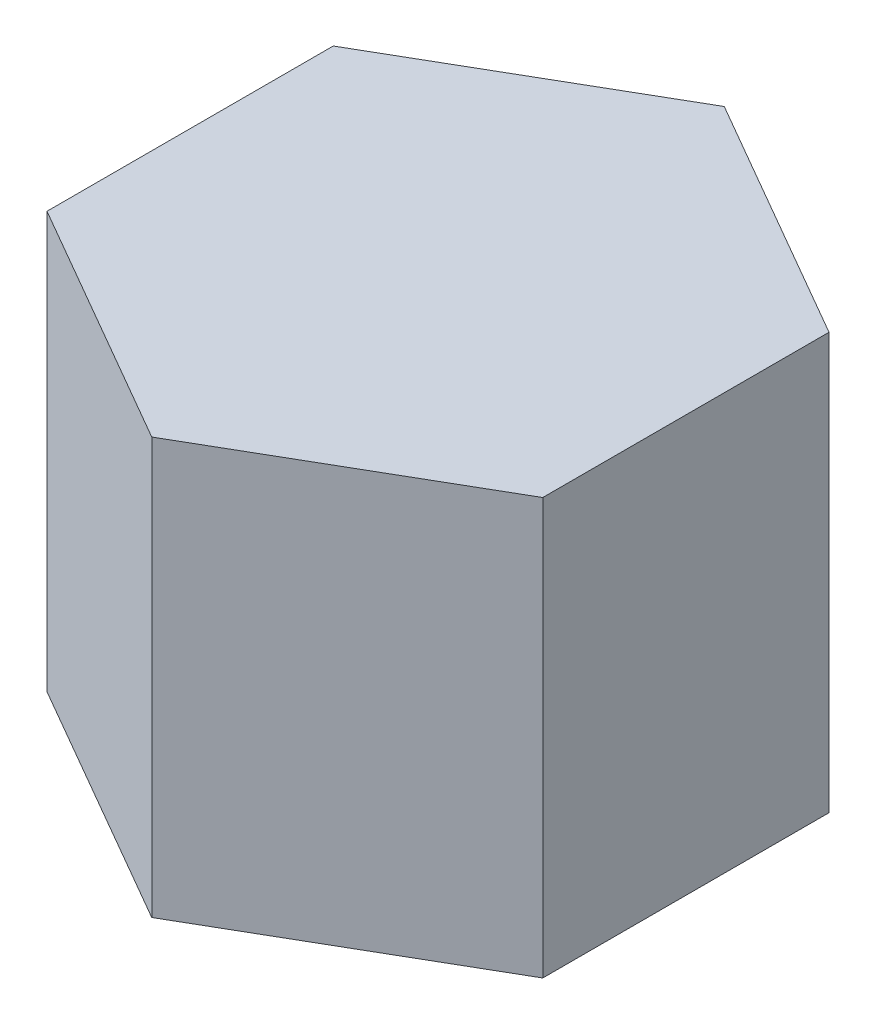
ISO-10303-21;
HEADER;
FILE_DESCRIPTION(('STEP AP214'),'2;1');
FILE_NAME('part.step','',(''),(''),'','','');
FILE_SCHEMA(('AUTOMOTIVE_DESIGN { 1 0 10303 214 1 1 1 1 }'));
ENDSEC;
DATA;
#1=APPLICATION_CONTEXT('core data for automotive mechanical design processes');
#2=APPLICATION_PROTOCOL_DEFINITION('international standard','automotive_design',2000,#1);
#3=PRODUCT_CONTEXT('',#1,'mechanical');
#4=PRODUCT('Part','Part','',(#3));
#5=PRODUCT_RELATED_PRODUCT_CATEGORY('part','',(#4));
#6=PRODUCT_DEFINITION_FORMATION('','',#4);
#7=PRODUCT_DEFINITION_CONTEXT('part definition',#1,'design');
#8=PRODUCT_DEFINITION('design','',#6,#7);
#9=PRODUCT_DEFINITION_SHAPE('','',#8);
#10=(LENGTH_UNIT() NAMED_UNIT(*) SI_UNIT(.MILLI.,.METRE.));
#11=(NAMED_UNIT(*) PLANE_ANGLE_UNIT() SI_UNIT($,.RADIAN.));
#12=(NAMED_UNIT(*) SI_UNIT($,.STERADIAN.) SOLID_ANGLE_UNIT());
#13=UNCERTAINTY_MEASURE_WITH_UNIT(LENGTH_MEASURE(1.E-05),#10,'distance_accuracy_value','');
#14=(GEOMETRIC_REPRESENTATION_CONTEXT(3) GLOBAL_UNCERTAINTY_ASSIGNED_CONTEXT((#13)) GLOBAL_UNIT_ASSIGNED_CONTEXT((#10,
#11,#12)) REPRESENTATION_CONTEXT('',''));
#15=CARTESIAN_POINT('',(0.,0.,0.));
#16=DIRECTION('',(0.,0.,1.));
#17=DIRECTION('',(1.,0.,0.));
#18=AXIS2_PLACEMENT_3D('',#15,#16,#17);
#19=CARTESIAN_POINT('',(205.839551417382,-147.556598747966,296.012098239417));
#20=DIRECTION('',(-0.500000000000096,0.,-0.866025403784383));
#21=DIRECTION('',(-0.866025403784383,0.,0.500000000000096));
#22=AXIS2_PLACEMENT_3D('',#19,#20,#21);
#23=PLANE('',#22);
#24=CARTESIAN_POINT('',(206.142660308706,-147.047793579175,295.837098239417));
#25=DIRECTION('',(-0.866025403784383,0.,0.500000000000096));
#26=VECTOR('',#25,1.);
#27=LINE('',#24,#26);
#28=CARTESIAN_POINT('',(206.142660308706,-147.047793579175,295.837098239417));
#29=VERTEX_POINT('',#28);
#30=CARTESIAN_POINT('',(205.839551417382,-147.047793579175,296.012098239417));
#31=VERTEX_POINT('',#30);
#32=EDGE_CURVE('E170',#29,#31,#27,.T.);
#33=ORIENTED_EDGE('',*,*,#32,.T.);
#34=CARTESIAN_POINT('',(205.839551417382,-147.556598747966,296.012098239417));
#35=DIRECTION('',(0.,1.,0.));
#36=VECTOR('',#35,1.);
#37=LINE('',#34,#36);
#38=CARTESIAN_POINT('',(205.839551417382,-147.556598747966,296.012098239417));
#39=VERTEX_POINT('',#38);
#40=EDGE_CURVE('E35',#39,#31,#37,.T.);
#41=ORIENTED_EDGE('',*,*,#40,.F.);
#42=CARTESIAN_POINT('',(206.142660308706,-147.556598747966,295.837098239417));
#43=DIRECTION('',(-0.866025403784383,0.,0.500000000000096));
#44=VECTOR('',#43,1.);
#45=LINE('',#42,#44);
#46=CARTESIAN_POINT('',(206.142660308706,-147.556598747966,295.837098239417));
#47=VERTEX_POINT('',#46);
#48=EDGE_CURVE('E159',#47,#39,#45,.T.);
#49=ORIENTED_EDGE('',*,*,#48,.F.);
#50=CARTESIAN_POINT('',(206.142660308706,-147.556598747966,295.837098239417));
#51=DIRECTION('',(0.,1.,0.));
#52=VECTOR('',#51,1.);
#53=LINE('',#50,#52);
#54=EDGE_CURVE('E10',#47,#29,#53,.T.);
#55=ORIENTED_EDGE('',*,*,#54,.T.);
#56=EDGE_LOOP('',(#33,#41,#49,#55));
#57=FACE_BOUND('',#56,.T.);
#58=ADVANCED_FACE('F16',(#57),#23,.F.);
#59=CARTESIAN_POINT('',(206.142660308706,-147.556598747966,291.594471220494));
#60=DIRECTION('',(-1.,0.,0.));
#61=DIRECTION('',(0.,-1.,0.));
#62=AXIS2_PLACEMENT_3D('',#59,#60,#61);
#63=PLANE('',#62);
#64=CARTESIAN_POINT('',(206.142660308706,-147.047793579175,295.487098239417));
#65=DIRECTION('',(0.,0.,1.));
#66=VECTOR('',#65,1.);
#67=LINE('',#64,#66);
#68=CARTESIAN_POINT('',(206.142660308706,-147.047793579175,295.487098239417));
#69=VERTEX_POINT('',#68);
#70=EDGE_CURVE('E167',#69,#29,#67,.T.);
#71=ORIENTED_EDGE('',*,*,#70,.T.);
#72=ORIENTED_EDGE('',*,*,#54,.F.);
#73=CARTESIAN_POINT('',(206.142660308706,-147.556598747966,295.487098239417));
#74=DIRECTION('',(0.,0.,1.));
#75=VECTOR('',#74,1.);
#76=LINE('',#73,#75);
#77=CARTESIAN_POINT('',(206.142660308706,-147.556598747966,295.487098239417));
#78=VERTEX_POINT('',#77);
#79=EDGE_CURVE('E156',#78,#47,#76,.T.);
#80=ORIENTED_EDGE('',*,*,#79,.F.);
#81=CARTESIAN_POINT('',(206.142660308706,-147.556598747966,295.487098239417));
#82=DIRECTION('',(0.,1.,0.));
#83=VECTOR('',#82,1.);
#84=LINE('',#81,#83);
#85=EDGE_CURVE('E27',#78,#69,#84,.T.);
#86=ORIENTED_EDGE('',*,*,#85,.T.);
#87=EDGE_LOOP('',(#71,#72,#80,#86));
#88=FACE_BOUND('',#87,.T.);
#89=ADVANCED_FACE('F189',(#88),#63,.F.);
#90=CARTESIAN_POINT('',(206.142660308706,-147.556598747966,295.487098239417));
#91=DIRECTION('',(-0.499999999999978,0.,0.866025403784452));
#92=DIRECTION('',(0.866025403784452,0.,0.499999999999978));
#93=AXIS2_PLACEMENT_3D('',#90,#91,#92);
#94=PLANE('',#93);
#95=CARTESIAN_POINT('',(205.839551417382,-147.047793579175,295.312098239417));
#96=DIRECTION('',(0.866025403784452,0.,0.499999999999978));
#97=VECTOR('',#96,1.);
#98=LINE('',#95,#97);
#99=CARTESIAN_POINT('',(205.839551417382,-147.047793579175,295.312098239417));
#100=VERTEX_POINT('',#99);
#101=EDGE_CURVE('E163',#100,#69,#98,.T.);
#102=ORIENTED_EDGE('',*,*,#101,.T.);
#103=ORIENTED_EDGE('',*,*,#85,.F.);
#104=CARTESIAN_POINT('',(205.839551417382,-147.556598747966,295.312098239417));
#105=DIRECTION('',(0.866025403784452,0.,0.499999999999978));
#106=VECTOR('',#105,1.);
#107=LINE('',#104,#106);
#108=CARTESIAN_POINT('',(205.839551417382,-147.556598747966,295.312098239417));
#109=VERTEX_POINT('',#108);
#110=EDGE_CURVE('E106',#109,#78,#107,.T.);
#111=ORIENTED_EDGE('',*,*,#110,.F.);
#112=CARTESIAN_POINT('',(205.839551417382,-147.556598747966,295.312098239417));
#113=DIRECTION('',(0.,1.,0.));
#114=VECTOR('',#113,1.);
#115=LINE('',#112,#114);
#116=EDGE_CURVE('E94',#109,#100,#115,.T.);
#117=ORIENTED_EDGE('',*,*,#116,.T.);
#118=EDGE_LOOP('',(#102,#103,#111,#117));
#119=FACE_BOUND('',#118,.T.);
#120=ADVANCED_FACE('F198',(#119),#94,.F.);
#121=CARTESIAN_POINT('',(205.839551417382,-147.556598747966,295.312098239417));
#122=DIRECTION('',(0.500000000000096,0.,0.866025403784383));
#123=DIRECTION('',(0.866025403784383,0.,-0.500000000000096));
#124=AXIS2_PLACEMENT_3D('',#121,#122,#123);
#125=PLANE('',#124);
#126=CARTESIAN_POINT('',(205.536442526057,-147.047793579175,295.487098239417));
#127=DIRECTION('',(0.866025403784383,0.,-0.500000000000096));
#128=VECTOR('',#127,1.);
#129=LINE('',#126,#128);
#130=CARTESIAN_POINT('',(205.536442526057,-147.047793579175,295.487098239417));
#131=VERTEX_POINT('',#130);
#132=EDGE_CURVE('E162',#131,#100,#129,.T.);
#133=ORIENTED_EDGE('',*,*,#132,.T.);
#134=ORIENTED_EDGE('',*,*,#116,.F.);
#135=CARTESIAN_POINT('',(205.536442526057,-147.556598747966,295.487098239417));
#136=DIRECTION('',(0.866025403784383,0.,-0.500000000000096));
#137=VECTOR('',#136,1.);
#138=LINE('',#135,#137);
#139=CARTESIAN_POINT('',(205.536442526057,-147.556598747966,295.487098239417));
#140=VERTEX_POINT('',#139);
#141=EDGE_CURVE('E98',#140,#109,#138,.T.);
#142=ORIENTED_EDGE('',*,*,#141,.F.);
#143=CARTESIAN_POINT('',(205.536442526057,-147.556598747966,295.487098239417));
#144=DIRECTION('',(0.,1.,0.));
#145=VECTOR('',#144,1.);
#146=LINE('',#143,#145);
#147=EDGE_CURVE('E79',#140,#131,#146,.T.);
#148=ORIENTED_EDGE('',*,*,#147,.T.);
#149=EDGE_LOOP('',(#133,#134,#142,#148));
#150=FACE_BOUND('',#149,.T.);
#151=ADVANCED_FACE('F100',(#150),#125,.F.);
#152=CARTESIAN_POINT('',(205.536442526057,-147.556598747966,291.594471220494));
#153=DIRECTION('',(1.,0.,0.));
#154=DIRECTION('',(0.,1.,0.));
#155=AXIS2_PLACEMENT_3D('',#152,#153,#154);
#156=PLANE('',#155);
#157=CARTESIAN_POINT('',(205.536442526057,-147.047793579175,295.837098239417));
#158=DIRECTION('',(0.,0.,-1.));
#159=VECTOR('',#158,1.);
#160=LINE('',#157,#159);
#161=CARTESIAN_POINT('',(205.536442526057,-147.047793579175,295.837098239417));
#162=VERTEX_POINT('',#161);
#163=EDGE_CURVE('E88',#162,#131,#160,.T.);
#164=ORIENTED_EDGE('',*,*,#163,.T.);
#165=ORIENTED_EDGE('',*,*,#147,.F.);
#166=CARTESIAN_POINT('',(205.536442526057,-147.556598747966,295.837098239417));
#167=DIRECTION('',(0.,0.,-1.));
#168=VECTOR('',#167,1.);
#169=LINE('',#166,#168);
#170=CARTESIAN_POINT('',(205.536442526057,-147.556598747966,295.837098239417));
#171=VERTEX_POINT('',#170);
#172=EDGE_CURVE('E84',#171,#140,#169,.T.);
#173=ORIENTED_EDGE('',*,*,#172,.F.);
#174=CARTESIAN_POINT('',(205.536442526057,-147.556598747966,295.837098239417));
#175=DIRECTION('',(0.,1.,0.));
#176=VECTOR('',#175,1.);
#177=LINE('',#174,#176);
#178=EDGE_CURVE('E58',#171,#162,#177,.T.);
#179=ORIENTED_EDGE('',*,*,#178,.T.);
#180=EDGE_LOOP('',(#164,#165,#173,#179));
#181=FACE_BOUND('',#180,.T.);
#182=ADVANCED_FACE('F82',(#181),#156,.F.);
#183=CARTESIAN_POINT('',(205.536442526057,-147.556598747966,295.837098239417));
#184=DIRECTION('',(0.500000000000062,0.,-0.866025403784403));
#185=DIRECTION('',(-0.866025403784403,0.,-0.500000000000062));
#186=AXIS2_PLACEMENT_3D('',#183,#184,#185);
#187=PLANE('',#186);
#188=CARTESIAN_POINT('',(205.839551417382,-147.047793579175,296.012098239417));
#189=DIRECTION('',(-0.866025403784403,0.,-0.500000000000062));
#190=VECTOR('',#189,1.);
#191=LINE('',#188,#190);
#192=EDGE_CURVE('E160',#31,#162,#191,.T.);
#193=ORIENTED_EDGE('',*,*,#192,.T.);
#194=ORIENTED_EDGE('',*,*,#178,.F.);
#195=CARTESIAN_POINT('',(205.839551417382,-147.556598747966,296.012098239417));
#196=DIRECTION('',(-0.866025403784403,0.,-0.500000000000062));
#197=VECTOR('',#196,1.);
#198=LINE('',#195,#197);
#199=EDGE_CURVE('E112',#39,#171,#198,.T.);
#200=ORIENTED_EDGE('',*,*,#199,.F.);
#201=ORIENTED_EDGE('',*,*,#40,.T.);
#202=EDGE_LOOP('',(#193,#194,#200,#201));
#203=FACE_BOUND('',#202,.T.);
#204=ADVANCED_FACE('F131',(#203),#187,.F.);
#205=CARTESIAN_POINT('',(206.491105863044,-147.556598747966,291.594471220494));
#206=DIRECTION('',(0.,1.,0.));
#207=DIRECTION('',(-1.,0.,0.));
#208=AXIS2_PLACEMENT_3D('',#205,#206,#207);
#209=PLANE('',#208);
#210=ORIENTED_EDGE('',*,*,#48,.T.);
#211=ORIENTED_EDGE('',*,*,#199,.T.);
#212=ORIENTED_EDGE('',*,*,#172,.T.);
#213=ORIENTED_EDGE('',*,*,#141,.T.);
#214=ORIENTED_EDGE('',*,*,#110,.T.);
#215=ORIENTED_EDGE('',*,*,#79,.T.);
#216=EDGE_LOOP('',(#210,#211,#212,#213,#214,#215));
#217=FACE_BOUND('',#216,.T.);
#218=ADVANCED_FACE('F111',(#217),#209,.F.);
#219=CARTESIAN_POINT('',(206.491105863044,-147.047793579175,291.594471220494));
#220=DIRECTION('',(0.,1.,0.));
#221=DIRECTION('',(-1.,0.,0.));
#222=AXIS2_PLACEMENT_3D('',#219,#220,#221);
#223=PLANE('',#222);
#224=ORIENTED_EDGE('',*,*,#32,.F.);
#225=ORIENTED_EDGE('',*,*,#70,.F.);
#226=ORIENTED_EDGE('',*,*,#101,.F.);
#227=ORIENTED_EDGE('',*,*,#132,.F.);
#228=ORIENTED_EDGE('',*,*,#163,.F.);
#229=ORIENTED_EDGE('',*,*,#192,.F.);
#230=EDGE_LOOP('',(#224,#225,#226,#227,#228,#229));
#231=FACE_BOUND('',#230,.T.);
#232=ADVANCED_FACE('F130',(#231),#223,.T.);
#233=CLOSED_SHELL('',(#58,#89,#120,#151,#182,#204,#218,#232));
#234=MANIFOLD_SOLID_BREP('B1',#233);
#235=ADVANCED_BREP_SHAPE_REPRESENTATION('',(#18,#234),#14);
#236=SHAPE_DEFINITION_REPRESENTATION(#9,#235);
ENDSEC;
END-ISO-10303-21;
